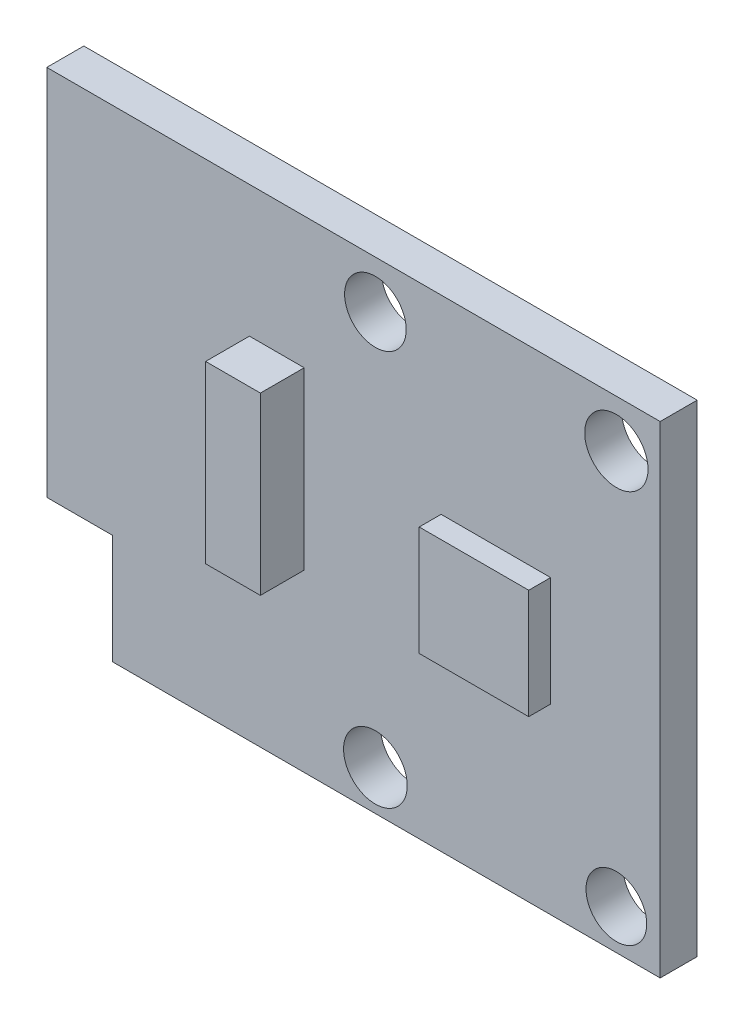
ISO-10303-21;
HEADER;
FILE_DESCRIPTION(('STEP AP214'),'2;1');
FILE_NAME('part.step','',(''),(''),'','','');
FILE_SCHEMA(('AUTOMOTIVE_DESIGN { 1 0 10303 214 1 1 1 1 }'));
ENDSEC;
DATA;
#1=APPLICATION_CONTEXT('core data for automotive mechanical design processes');
#2=APPLICATION_PROTOCOL_DEFINITION('international standard','automotive_design',2000,#1);
#3=PRODUCT_CONTEXT('',#1,'mechanical');
#4=PRODUCT('Part','Part','',(#3));
#5=PRODUCT_RELATED_PRODUCT_CATEGORY('part','',(#4));
#6=PRODUCT_DEFINITION_FORMATION('','',#4);
#7=PRODUCT_DEFINITION_CONTEXT('part definition',#1,'design');
#8=PRODUCT_DEFINITION('design','',#6,#7);
#9=PRODUCT_DEFINITION_SHAPE('','',#8);
#10=(LENGTH_UNIT() NAMED_UNIT(*) SI_UNIT(.MILLI.,.METRE.));
#11=(NAMED_UNIT(*) PLANE_ANGLE_UNIT() SI_UNIT($,.RADIAN.));
#12=(NAMED_UNIT(*) SI_UNIT($,.STERADIAN.) SOLID_ANGLE_UNIT());
#13=UNCERTAINTY_MEASURE_WITH_UNIT(LENGTH_MEASURE(1.E-05),#10,'distance_accuracy_value','');
#14=(GEOMETRIC_REPRESENTATION_CONTEXT(3) GLOBAL_UNCERTAINTY_ASSIGNED_CONTEXT((#13)) GLOBAL_UNIT_ASSIGNED_CONTEXT((#10,
#11,#12)) REPRESENTATION_CONTEXT('',''));
#15=CARTESIAN_POINT('',(0.,0.,0.));
#16=DIRECTION('',(0.,0.,1.));
#17=DIRECTION('',(1.,0.,0.));
#18=AXIS2_PLACEMENT_3D('',#15,#16,#17);
#19=CARTESIAN_POINT('',(0.,0.,1.69));
#20=DIRECTION('',(0.,0.,-1.));
#21=DIRECTION('',(-1.,0.,0.));
#22=AXIS2_PLACEMENT_3D('',#19,#20,#21);
#23=PLANE('',#22);
#24=DIRECTION('',(0.,-1.,0.));
#25=VECTOR('',#24,1.);
#26=CARTESIAN_POINT('',(18.,13.3304019796908,1.69));
#27=LINE('',#26,#25);
#28=CARTESIAN_POINT('',(18.,13.3304019796908,1.69));
#29=VERTEX_POINT('',#28);
#30=CARTESIAN_POINT('',(18.,8.33040197969078,1.69));
#31=VERTEX_POINT('',#30);
#32=EDGE_CURVE('E229',#29,#31,#27,.T.);
#33=ORIENTED_EDGE('',*,*,#32,.F.);
#34=DIRECTION('',(-1.,0.,0.));
#35=VECTOR('',#34,1.);
#36=CARTESIAN_POINT('',(18.,13.3304019796908,1.69));
#37=LINE('',#36,#35);
#38=CARTESIAN_POINT('',(23.,13.3304019796908,1.69));
#39=VERTEX_POINT('',#38);
#40=EDGE_CURVE('E234',#39,#29,#37,.T.);
#41=ORIENTED_EDGE('',*,*,#40,.F.);
#42=DIRECTION('',(0.,1.,0.));
#43=VECTOR('',#42,1.);
#44=CARTESIAN_POINT('',(23.,13.3304019796908,1.69));
#45=LINE('',#44,#43);
#46=CARTESIAN_POINT('',(23.,8.33040197969078,1.69));
#47=VERTEX_POINT('',#46);
#48=EDGE_CURVE('E246',#47,#39,#45,.T.);
#49=ORIENTED_EDGE('',*,*,#48,.F.);
#50=DIRECTION('',(1.,0.,0.));
#51=VECTOR('',#50,1.);
#52=CARTESIAN_POINT('',(18.,8.33040197969078,1.69));
#53=LINE('',#52,#51);
#54=EDGE_CURVE('E243',#31,#47,#53,.T.);
#55=ORIENTED_EDGE('',*,*,#54,.F.);
#56=EDGE_LOOP('',(#33,#41,#49,#55));
#57=FACE_BOUND('',#56,.T.);
#58=CARTESIAN_POINT('',(26.,1.8262889014553,1.69));
#59=DIRECTION('',(0.,0.,1.));
#60=DIRECTION('',(1.,0.,0.));
#61=AXIS2_PLACEMENT_3D('',#58,#59,#60);
#62=CIRCLE('',#61,1.38590599606651);
#63=CARTESIAN_POINT('',(27.3859059960665,1.8262889014553,1.69));
#64=VERTEX_POINT('',#63);
#65=EDGE_CURVE('E267',#64,#64,#62,.T.);
#66=ORIENTED_EDGE('',*,*,#65,.F.);
#67=EDGE_LOOP('',(#66));
#68=FACE_BOUND('',#67,.T.);
#69=CARTESIAN_POINT('',(15.,1.8262889014553,1.69));
#70=DIRECTION('',(0.,0.,1.));
#71=DIRECTION('',(1.,0.,0.));
#72=AXIS2_PLACEMENT_3D('',#69,#70,#71);
#73=CIRCLE('',#72,1.45322335303376);
#74=CARTESIAN_POINT('',(16.4532233530338,1.8262889014553,1.69));
#75=VERTEX_POINT('',#74);
#76=EDGE_CURVE('E273',#75,#75,#73,.T.);
#77=ORIENTED_EDGE('',*,*,#76,.F.);
#78=EDGE_LOOP('',(#77));
#79=FACE_BOUND('',#78,.T.);
#80=CARTESIAN_POINT('',(15.,19.8345150579263,1.69));
#81=DIRECTION('',(0.,0.,1.));
#82=DIRECTION('',(1.,0.,0.));
#83=AXIS2_PLACEMENT_3D('',#80,#81,#82);
#84=CIRCLE('',#83,1.40633814474217);
#85=CARTESIAN_POINT('',(16.4063381447422,19.8345150579263,1.69));
#86=VERTEX_POINT('',#85);
#87=EDGE_CURVE('E262',#86,#86,#84,.T.);
#88=ORIENTED_EDGE('',*,*,#87,.F.);
#89=EDGE_LOOP('',(#88));
#90=FACE_BOUND('',#89,.T.);
#91=CARTESIAN_POINT('',(26.,19.8345150579263,1.69));
#92=DIRECTION('',(0.,0.,1.));
#93=DIRECTION('',(1.,0.,0.));
#94=AXIS2_PLACEMENT_3D('',#91,#92,#93);
#95=CIRCLE('',#94,1.44535030177227);
#96=CARTESIAN_POINT('',(27.4453503017723,19.8345150579263,1.69));
#97=VERTEX_POINT('',#96);
#98=EDGE_CURVE('E266',#97,#97,#95,.T.);
#99=ORIENTED_EDGE('',*,*,#98,.F.);
#100=EDGE_LOOP('',(#99));
#101=FACE_BOUND('',#100,.T.);
#102=DIRECTION('',(0.,-1.,0.));
#103=VECTOR('',#102,1.);
#104=CARTESIAN_POINT('',(0.,0.,1.69));
#105=LINE('',#104,#103);
#106=CARTESIAN_POINT('',(0.,22.,1.69));
#107=VERTEX_POINT('',#106);
#108=CARTESIAN_POINT('',(0.,5.,1.69));
#109=VERTEX_POINT('',#108);
#110=EDGE_CURVE('E152',#107,#109,#105,.T.);
#111=ORIENTED_EDGE('',*,*,#110,.T.);
#112=DIRECTION('',(-1.,0.,0.));
#113=VECTOR('',#112,1.);
#114=CARTESIAN_POINT('',(0.,5.,1.69));
#115=LINE('',#114,#113);
#116=CARTESIAN_POINT('',(3.,5.,1.69));
#117=VERTEX_POINT('',#116);
#118=EDGE_CURVE('E140',#117,#109,#115,.T.);
#119=ORIENTED_EDGE('',*,*,#118,.F.);
#120=DIRECTION('',(0.,1.,0.));
#121=VECTOR('',#120,1.);
#122=CARTESIAN_POINT('',(3.,5.,1.69));
#123=LINE('',#122,#121);
#124=CARTESIAN_POINT('',(3.,0.,1.69));
#125=VERTEX_POINT('',#124);
#126=EDGE_CURVE('E134',#125,#117,#123,.T.);
#127=ORIENTED_EDGE('',*,*,#126,.F.);
#128=DIRECTION('',(1.,0.,0.));
#129=VECTOR('',#128,1.);
#130=CARTESIAN_POINT('',(0.,0.,1.69));
#131=LINE('',#130,#129);
#132=CARTESIAN_POINT('',(28.,0.,1.69));
#133=VERTEX_POINT('',#132);
#134=EDGE_CURVE('E144',#125,#133,#131,.T.);
#135=ORIENTED_EDGE('',*,*,#134,.T.);
#136=DIRECTION('',(0.,1.,0.));
#137=VECTOR('',#136,1.);
#138=CARTESIAN_POINT('',(28.,0.,1.69));
#139=LINE('',#138,#137);
#140=CARTESIAN_POINT('',(28.,22.,1.69));
#141=VERTEX_POINT('',#140);
#142=EDGE_CURVE('E151',#133,#141,#139,.T.);
#143=ORIENTED_EDGE('',*,*,#142,.T.);
#144=DIRECTION('',(-1.,0.,0.));
#145=VECTOR('',#144,1.);
#146=CARTESIAN_POINT('',(0.,22.,1.69));
#147=LINE('',#146,#145);
#148=EDGE_CURVE('E154',#141,#107,#147,.T.);
#149=ORIENTED_EDGE('',*,*,#148,.T.);
#150=EDGE_LOOP('',(#111,#119,#127,#135,#143,#149));
#151=FACE_BOUND('',#150,.T.);
#152=DIRECTION('',(0.,-1.,0.));
#153=VECTOR('',#152,1.);
#154=CARTESIAN_POINT('',(9.25000000000001,16.,1.69));
#155=LINE('',#154,#153);
#156=CARTESIAN_POINT('',(9.25000000000001,16.,1.69));
#157=VERTEX_POINT('',#156);
#158=CARTESIAN_POINT('',(9.25000000000001,8.,1.69));
#159=VERTEX_POINT('',#158);
#160=EDGE_CURVE('E195',#157,#159,#155,.T.);
#161=ORIENTED_EDGE('',*,*,#160,.F.);
#162=DIRECTION('',(-1.,0.,0.));
#163=VECTOR('',#162,1.);
#164=CARTESIAN_POINT('',(9.25000000000001,16.,1.69));
#165=LINE('',#164,#163);
#166=CARTESIAN_POINT('',(11.75,16.,1.69));
#167=VERTEX_POINT('',#166);
#168=EDGE_CURVE('E206',#167,#157,#165,.T.);
#169=ORIENTED_EDGE('',*,*,#168,.F.);
#170=DIRECTION('',(0.,1.,0.));
#171=VECTOR('',#170,1.);
#172=CARTESIAN_POINT('',(11.75,16.,1.69));
#173=LINE('',#172,#171);
#174=CARTESIAN_POINT('',(11.75,8.,1.69));
#175=VERTEX_POINT('',#174);
#176=EDGE_CURVE('E214',#175,#167,#173,.T.);
#177=ORIENTED_EDGE('',*,*,#176,.F.);
#178=DIRECTION('',(1.,0.,0.));
#179=VECTOR('',#178,1.);
#180=CARTESIAN_POINT('',(9.25000000000001,8.,1.69));
#181=LINE('',#180,#179);
#182=EDGE_CURVE('E55',#159,#175,#181,.T.);
#183=ORIENTED_EDGE('',*,*,#182,.F.);
#184=EDGE_LOOP('',(#161,#169,#177,#183));
#185=FACE_BOUND('',#184,.T.);
#186=ADVANCED_FACE('F33',(#57,#68,#79,#90,#101,#151,#185),#23,.F.);
#187=CARTESIAN_POINT('',(0.,0.,1.69));
#188=DIRECTION('',(1.,0.,0.));
#189=DIRECTION('',(0.,0.,-1.));
#190=AXIS2_PLACEMENT_3D('',#187,#188,#189);
#191=PLANE('',#190);
#192=DIRECTION('',(0.,-1.,0.));
#193=VECTOR('',#192,1.);
#194=CARTESIAN_POINT('',(0.,0.,0.));
#195=LINE('',#194,#193);
#196=CARTESIAN_POINT('',(0.,22.,0.));
#197=VERTEX_POINT('',#196);
#198=CARTESIAN_POINT('',(0.,5.,0.));
#199=VERTEX_POINT('',#198);
#200=EDGE_CURVE('E162',#197,#199,#195,.T.);
#201=ORIENTED_EDGE('',*,*,#200,.T.);
#202=DIRECTION('',(0.,0.,1.));
#203=VECTOR('',#202,1.);
#204=CARTESIAN_POINT('',(0.,5.,-8.31));
#205=LINE('',#204,#203);
#206=EDGE_CURVE('E193',#199,#109,#205,.T.);
#207=ORIENTED_EDGE('',*,*,#206,.T.);
#208=ORIENTED_EDGE('',*,*,#110,.F.);
#209=DIRECTION('',(0.,0.,-1.));
#210=VECTOR('',#209,1.);
#211=CARTESIAN_POINT('',(0.,22.,1.69));
#212=LINE('',#211,#210);
#213=EDGE_CURVE('E161',#107,#197,#212,.T.);
#214=ORIENTED_EDGE('',*,*,#213,.T.);
#215=EDGE_LOOP('',(#201,#207,#208,#214));
#216=FACE_BOUND('',#215,.T.);
#217=ADVANCED_FACE('F35',(#216),#191,.F.);
#218=CARTESIAN_POINT('',(0.,0.,1.69));
#219=DIRECTION('',(0.,1.,0.));
#220=DIRECTION('',(0.,0.,1.));
#221=AXIS2_PLACEMENT_3D('',#218,#219,#220);
#222=PLANE('',#221);
#223=ORIENTED_EDGE('',*,*,#134,.F.);
#224=DIRECTION('',(0.,0.,1.));
#225=VECTOR('',#224,1.);
#226=CARTESIAN_POINT('',(3.,0.,-8.31));
#227=LINE('',#226,#225);
#228=CARTESIAN_POINT('',(3.,0.,0.));
#229=VERTEX_POINT('',#228);
#230=EDGE_CURVE('E131',#229,#125,#227,.T.);
#231=ORIENTED_EDGE('',*,*,#230,.F.);
#232=DIRECTION('',(1.,0.,0.));
#233=VECTOR('',#232,1.);
#234=CARTESIAN_POINT('',(0.,0.,0.));
#235=LINE('',#234,#233);
#236=CARTESIAN_POINT('',(28.,0.,0.));
#237=VERTEX_POINT('',#236);
#238=EDGE_CURVE('E165',#229,#237,#235,.T.);
#239=ORIENTED_EDGE('',*,*,#238,.T.);
#240=DIRECTION('',(0.,0.,-1.));
#241=VECTOR('',#240,1.);
#242=CARTESIAN_POINT('',(28.,0.,1.69));
#243=LINE('',#242,#241);
#244=EDGE_CURVE('E149',#133,#237,#243,.T.);
#245=ORIENTED_EDGE('',*,*,#244,.F.);
#246=EDGE_LOOP('',(#223,#231,#239,#245));
#247=FACE_BOUND('',#246,.T.);
#248=ADVANCED_FACE('F147',(#247),#222,.F.);
#249=CARTESIAN_POINT('',(28.,0.,1.69));
#250=DIRECTION('',(-1.,0.,0.));
#251=DIRECTION('',(0.,-1.,0.));
#252=AXIS2_PLACEMENT_3D('',#249,#250,#251);
#253=PLANE('',#252);
#254=DIRECTION('',(0.,1.,0.));
#255=VECTOR('',#254,1.);
#256=CARTESIAN_POINT('',(28.,0.,0.));
#257=LINE('',#256,#255);
#258=CARTESIAN_POINT('',(28.,22.,0.));
#259=VERTEX_POINT('',#258);
#260=EDGE_CURVE('E168',#237,#259,#257,.T.);
#261=ORIENTED_EDGE('',*,*,#260,.T.);
#262=DIRECTION('',(0.,0.,-1.));
#263=VECTOR('',#262,1.);
#264=CARTESIAN_POINT('',(28.,22.,1.69));
#265=LINE('',#264,#263);
#266=EDGE_CURVE('E173',#141,#259,#265,.T.);
#267=ORIENTED_EDGE('',*,*,#266,.F.);
#268=ORIENTED_EDGE('',*,*,#142,.F.);
#269=ORIENTED_EDGE('',*,*,#244,.T.);
#270=EDGE_LOOP('',(#261,#267,#268,#269));
#271=FACE_BOUND('',#270,.T.);
#272=ADVANCED_FACE('F178',(#271),#253,.F.);
#273=CARTESIAN_POINT('',(0.,22.,1.69));
#274=DIRECTION('',(0.,-1.,0.));
#275=DIRECTION('',(0.,0.,-1.));
#276=AXIS2_PLACEMENT_3D('',#273,#274,#275);
#277=PLANE('',#276);
#278=DIRECTION('',(-1.,0.,0.));
#279=VECTOR('',#278,1.);
#280=CARTESIAN_POINT('',(0.,22.,0.));
#281=LINE('',#280,#279);
#282=EDGE_CURVE('E156',#259,#197,#281,.T.);
#283=ORIENTED_EDGE('',*,*,#282,.T.);
#284=ORIENTED_EDGE('',*,*,#213,.F.);
#285=ORIENTED_EDGE('',*,*,#148,.F.);
#286=ORIENTED_EDGE('',*,*,#266,.T.);
#287=EDGE_LOOP('',(#283,#284,#285,#286));
#288=FACE_BOUND('',#287,.T.);
#289=ADVANCED_FACE('F188',(#288),#277,.F.);
#290=CARTESIAN_POINT('',(0.,0.,0.));
#291=DIRECTION('',(0.,0.,-1.));
#292=DIRECTION('',(-1.,0.,0.));
#293=AXIS2_PLACEMENT_3D('',#290,#291,#292);
#294=PLANE('',#293);
#295=DIRECTION('',(1.,0.,0.));
#296=VECTOR('',#295,1.);
#297=CARTESIAN_POINT('',(0.,5.,0.));
#298=LINE('',#297,#296);
#299=CARTESIAN_POINT('',(3.,5.,0.));
#300=VERTEX_POINT('',#299);
#301=EDGE_CURVE('E11',#199,#300,#298,.T.);
#302=ORIENTED_EDGE('',*,*,#301,.F.);
#303=ORIENTED_EDGE('',*,*,#200,.F.);
#304=ORIENTED_EDGE('',*,*,#282,.F.);
#305=ORIENTED_EDGE('',*,*,#260,.F.);
#306=ORIENTED_EDGE('',*,*,#238,.F.);
#307=DIRECTION('',(0.,-1.,0.));
#308=VECTOR('',#307,1.);
#309=CARTESIAN_POINT('',(3.,0.,0.));
#310=LINE('',#309,#308);
#311=EDGE_CURVE('E41',#300,#229,#310,.T.);
#312=ORIENTED_EDGE('',*,*,#311,.F.);
#313=EDGE_LOOP('',(#302,#303,#304,#305,#306,#312));
#314=FACE_BOUND('',#313,.T.);
#315=CARTESIAN_POINT('',(26.,1.8262889014553,0.));
#316=DIRECTION('',(0.,0.,1.));
#317=DIRECTION('',(1.,0.,0.));
#318=AXIS2_PLACEMENT_3D('',#315,#316,#317);
#319=CIRCLE('',#318,1.38590599606651);
#320=CARTESIAN_POINT('',(27.3859059960665,1.8262889014553,0.));
#321=VERTEX_POINT('',#320);
#322=EDGE_CURVE('E263',#321,#321,#319,.T.);
#323=ORIENTED_EDGE('',*,*,#322,.T.);
#324=EDGE_LOOP('',(#323));
#325=FACE_BOUND('',#324,.T.);
#326=CARTESIAN_POINT('',(15.,1.8262889014553,0.));
#327=DIRECTION('',(0.,0.,1.));
#328=DIRECTION('',(1.,0.,0.));
#329=AXIS2_PLACEMENT_3D('',#326,#327,#328);
#330=CIRCLE('',#329,1.45322335303376);
#331=CARTESIAN_POINT('',(16.4532233530338,1.8262889014553,0.));
#332=VERTEX_POINT('',#331);
#333=EDGE_CURVE('E270',#332,#332,#330,.T.);
#334=ORIENTED_EDGE('',*,*,#333,.T.);
#335=EDGE_LOOP('',(#334));
#336=FACE_BOUND('',#335,.T.);
#337=CARTESIAN_POINT('',(15.,19.8345150579263,0.));
#338=DIRECTION('',(0.,0.,1.));
#339=DIRECTION('',(1.,0.,0.));
#340=AXIS2_PLACEMENT_3D('',#337,#338,#339);
#341=CIRCLE('',#340,1.40633814474217);
#342=CARTESIAN_POINT('',(16.4063381447422,19.8345150579263,0.));
#343=VERTEX_POINT('',#342);
#344=EDGE_CURVE('E276',#343,#343,#341,.T.);
#345=ORIENTED_EDGE('',*,*,#344,.T.);
#346=EDGE_LOOP('',(#345));
#347=FACE_BOUND('',#346,.T.);
#348=CARTESIAN_POINT('',(26.,19.8345150579263,0.));
#349=DIRECTION('',(0.,0.,1.));
#350=DIRECTION('',(1.,0.,0.));
#351=AXIS2_PLACEMENT_3D('',#348,#349,#350);
#352=CIRCLE('',#351,1.44535030177227);
#353=CARTESIAN_POINT('',(27.4453503017723,19.8345150579263,0.));
#354=VERTEX_POINT('',#353);
#355=EDGE_CURVE('E166',#354,#354,#352,.T.);
#356=ORIENTED_EDGE('',*,*,#355,.T.);
#357=EDGE_LOOP('',(#356));
#358=FACE_BOUND('',#357,.T.);
#359=ADVANCED_FACE('F183',(#314,#325,#336,#347,#358),#294,.T.);
#360=CARTESIAN_POINT('',(26.,19.8345150579263,0.));
#361=DIRECTION('',(0.,0.,1.));
#362=DIRECTION('',(1.,0.,0.));
#363=AXIS2_PLACEMENT_3D('',#360,#361,#362);
#364=CYLINDRICAL_SURFACE('',#363,1.44535030177227);
#365=ORIENTED_EDGE('',*,*,#355,.F.);
#366=EDGE_LOOP('',(#365));
#367=FACE_BOUND('',#366,.T.);
#368=ORIENTED_EDGE('',*,*,#98,.T.);
#369=EDGE_LOOP('',(#368));
#370=FACE_BOUND('',#369,.T.);
#371=ADVANCED_FACE('F285',(#367,#370),#364,.F.);
#372=CARTESIAN_POINT('',(15.,19.8345150579263,0.));
#373=DIRECTION('',(0.,0.,1.));
#374=DIRECTION('',(1.,0.,0.));
#375=AXIS2_PLACEMENT_3D('',#372,#373,#374);
#376=CYLINDRICAL_SURFACE('',#375,1.40633814474217);
#377=ORIENTED_EDGE('',*,*,#344,.F.);
#378=EDGE_LOOP('',(#377));
#379=FACE_BOUND('',#378,.T.);
#380=ORIENTED_EDGE('',*,*,#87,.T.);
#381=EDGE_LOOP('',(#380));
#382=FACE_BOUND('',#381,.T.);
#383=ADVANCED_FACE('F380',(#379,#382),#376,.F.);
#384=CARTESIAN_POINT('',(15.,1.8262889014553,0.));
#385=DIRECTION('',(0.,0.,1.));
#386=DIRECTION('',(1.,0.,0.));
#387=AXIS2_PLACEMENT_3D('',#384,#385,#386);
#388=CYLINDRICAL_SURFACE('',#387,1.45322335303376);
#389=ORIENTED_EDGE('',*,*,#333,.F.);
#390=EDGE_LOOP('',(#389));
#391=FACE_BOUND('',#390,.T.);
#392=ORIENTED_EDGE('',*,*,#76,.T.);
#393=EDGE_LOOP('',(#392));
#394=FACE_BOUND('',#393,.T.);
#395=ADVANCED_FACE('F377',(#391,#394),#388,.F.);
#396=CARTESIAN_POINT('',(26.,1.8262889014553,0.));
#397=DIRECTION('',(0.,0.,1.));
#398=DIRECTION('',(1.,0.,0.));
#399=AXIS2_PLACEMENT_3D('',#396,#397,#398);
#400=CYLINDRICAL_SURFACE('',#399,1.38590599606651);
#401=ORIENTED_EDGE('',*,*,#322,.F.);
#402=EDGE_LOOP('',(#401));
#403=FACE_BOUND('',#402,.T.);
#404=ORIENTED_EDGE('',*,*,#65,.T.);
#405=EDGE_LOOP('',(#404));
#406=FACE_BOUND('',#405,.T.);
#407=ADVANCED_FACE('F373',(#403,#406),#400,.F.);
#408=CARTESIAN_POINT('',(18.,13.3304019796908,2.69));
#409=DIRECTION('',(1.,0.,0.));
#410=DIRECTION('',(0.,1.,0.));
#411=AXIS2_PLACEMENT_3D('',#408,#409,#410);
#412=PLANE('',#411);
#413=ORIENTED_EDGE('',*,*,#32,.T.);
#414=DIRECTION('',(0.,0.,-1.));
#415=VECTOR('',#414,1.);
#416=CARTESIAN_POINT('',(18.,8.33040197969078,2.69));
#417=LINE('',#416,#415);
#418=CARTESIAN_POINT('',(18.,8.33040197969078,2.69));
#419=VERTEX_POINT('',#418);
#420=EDGE_CURVE('E259',#419,#31,#417,.T.);
#421=ORIENTED_EDGE('',*,*,#420,.F.);
#422=DIRECTION('',(0.,-1.,0.));
#423=VECTOR('',#422,1.);
#424=CARTESIAN_POINT('',(18.,13.3304019796908,2.69));
#425=LINE('',#424,#423);
#426=CARTESIAN_POINT('',(18.,13.3304019796908,2.69));
#427=VERTEX_POINT('',#426);
#428=EDGE_CURVE('E230',#427,#419,#425,.T.);
#429=ORIENTED_EDGE('',*,*,#428,.F.);
#430=DIRECTION('',(0.,0.,-1.));
#431=VECTOR('',#430,1.);
#432=CARTESIAN_POINT('',(18.,13.3304019796908,2.69));
#433=LINE('',#432,#431);
#434=EDGE_CURVE('E240',#427,#29,#433,.T.);
#435=ORIENTED_EDGE('',*,*,#434,.T.);
#436=EDGE_LOOP('',(#413,#421,#429,#435));
#437=FACE_BOUND('',#436,.T.);
#438=ADVANCED_FACE('F369',(#437),#412,.F.);
#439=CARTESIAN_POINT('',(18.,8.33040197969078,2.69));
#440=DIRECTION('',(0.,1.,0.));
#441=DIRECTION('',(0.,0.,1.));
#442=AXIS2_PLACEMENT_3D('',#439,#440,#441);
#443=PLANE('',#442);
#444=ORIENTED_EDGE('',*,*,#54,.T.);
#445=DIRECTION('',(0.,0.,-1.));
#446=VECTOR('',#445,1.);
#447=CARTESIAN_POINT('',(23.,8.33040197969078,2.69));
#448=LINE('',#447,#446);
#449=CARTESIAN_POINT('',(23.,8.33040197969078,2.69));
#450=VERTEX_POINT('',#449);
#451=EDGE_CURVE('E256',#450,#47,#448,.T.);
#452=ORIENTED_EDGE('',*,*,#451,.F.);
#453=DIRECTION('',(1.,0.,0.));
#454=VECTOR('',#453,1.);
#455=CARTESIAN_POINT('',(18.,8.33040197969078,2.69));
#456=LINE('',#455,#454);
#457=EDGE_CURVE('E233',#419,#450,#456,.T.);
#458=ORIENTED_EDGE('',*,*,#457,.F.);
#459=ORIENTED_EDGE('',*,*,#420,.T.);
#460=EDGE_LOOP('',(#444,#452,#458,#459));
#461=FACE_BOUND('',#460,.T.);
#462=ADVANCED_FACE('F365',(#461),#443,.F.);
#463=CARTESIAN_POINT('',(23.,13.3304019796908,2.69));
#464=DIRECTION('',(-1.,0.,0.));
#465=DIRECTION('',(0.,-1.,0.));
#466=AXIS2_PLACEMENT_3D('',#463,#464,#465);
#467=PLANE('',#466);
#468=ORIENTED_EDGE('',*,*,#48,.T.);
#469=DIRECTION('',(0.,0.,-1.));
#470=VECTOR('',#469,1.);
#471=CARTESIAN_POINT('',(23.,13.3304019796908,2.69));
#472=LINE('',#471,#470);
#473=CARTESIAN_POINT('',(23.,13.3304019796908,2.69));
#474=VERTEX_POINT('',#473);
#475=EDGE_CURVE('E253',#474,#39,#472,.T.);
#476=ORIENTED_EDGE('',*,*,#475,.F.);
#477=DIRECTION('',(0.,1.,0.));
#478=VECTOR('',#477,1.);
#479=CARTESIAN_POINT('',(23.,13.3304019796908,2.69));
#480=LINE('',#479,#478);
#481=EDGE_CURVE('E236',#450,#474,#480,.T.);
#482=ORIENTED_EDGE('',*,*,#481,.F.);
#483=ORIENTED_EDGE('',*,*,#451,.T.);
#484=EDGE_LOOP('',(#468,#476,#482,#483));
#485=FACE_BOUND('',#484,.T.);
#486=ADVANCED_FACE('F361',(#485),#467,.F.);
#487=CARTESIAN_POINT('',(18.,13.3304019796908,2.69));
#488=DIRECTION('',(0.,-1.,0.));
#489=DIRECTION('',(0.,0.,-1.));
#490=AXIS2_PLACEMENT_3D('',#487,#488,#489);
#491=PLANE('',#490);
#492=ORIENTED_EDGE('',*,*,#40,.T.);
#493=ORIENTED_EDGE('',*,*,#434,.F.);
#494=DIRECTION('',(-1.,0.,0.));
#495=VECTOR('',#494,1.);
#496=CARTESIAN_POINT('',(18.,13.3304019796908,2.69));
#497=LINE('',#496,#495);
#498=EDGE_CURVE('E238',#474,#427,#497,.T.);
#499=ORIENTED_EDGE('',*,*,#498,.F.);
#500=ORIENTED_EDGE('',*,*,#475,.T.);
#501=EDGE_LOOP('',(#492,#493,#499,#500));
#502=FACE_BOUND('',#501,.T.);
#503=ADVANCED_FACE('F357',(#502),#491,.F.);
#504=CARTESIAN_POINT('',(0.,0.,2.69));
#505=DIRECTION('',(0.,0.,1.));
#506=DIRECTION('',(1.,0.,0.));
#507=AXIS2_PLACEMENT_3D('',#504,#505,#506);
#508=PLANE('',#507);
#509=ORIENTED_EDGE('',*,*,#428,.T.);
#510=ORIENTED_EDGE('',*,*,#457,.T.);
#511=ORIENTED_EDGE('',*,*,#481,.T.);
#512=ORIENTED_EDGE('',*,*,#498,.T.);
#513=EDGE_LOOP('',(#509,#510,#511,#512));
#514=FACE_BOUND('',#513,.T.);
#515=ADVANCED_FACE('F353',(#514),#508,.T.);
#516=CARTESIAN_POINT('',(9.25000000000001,16.,3.69));
#517=DIRECTION('',(1.,0.,0.));
#518=DIRECTION('',(0.,0.,-1.));
#519=AXIS2_PLACEMENT_3D('',#516,#517,#518);
#520=PLANE('',#519);
#521=ORIENTED_EDGE('',*,*,#160,.T.);
#522=DIRECTION('',(0.,0.,-1.));
#523=VECTOR('',#522,1.);
#524=CARTESIAN_POINT('',(9.25000000000001,8.,3.69));
#525=LINE('',#524,#523);
#526=CARTESIAN_POINT('',(9.25000000000001,8.,3.69));
#527=VERTEX_POINT('',#526);
#528=EDGE_CURVE('E227',#527,#159,#525,.T.);
#529=ORIENTED_EDGE('',*,*,#528,.F.);
#530=DIRECTION('',(0.,-1.,0.));
#531=VECTOR('',#530,1.);
#532=CARTESIAN_POINT('',(9.25000000000001,16.,3.69));
#533=LINE('',#532,#531);
#534=CARTESIAN_POINT('',(9.25000000000001,16.,3.69));
#535=VERTEX_POINT('',#534);
#536=EDGE_CURVE('E202',#535,#527,#533,.T.);
#537=ORIENTED_EDGE('',*,*,#536,.F.);
#538=DIRECTION('',(0.,0.,-1.));
#539=VECTOR('',#538,1.);
#540=CARTESIAN_POINT('',(9.25000000000001,16.,3.69));
#541=LINE('',#540,#539);
#542=EDGE_CURVE('E211',#535,#157,#541,.T.);
#543=ORIENTED_EDGE('',*,*,#542,.T.);
#544=EDGE_LOOP('',(#521,#529,#537,#543));
#545=FACE_BOUND('',#544,.T.);
#546=ADVANCED_FACE('F349',(#545),#520,.F.);
#547=CARTESIAN_POINT('',(9.25000000000001,8.,3.69));
#548=DIRECTION('',(0.,1.,0.));
#549=DIRECTION('',(0.,0.,1.));
#550=AXIS2_PLACEMENT_3D('',#547,#548,#549);
#551=PLANE('',#550);
#552=ORIENTED_EDGE('',*,*,#182,.T.);
#553=DIRECTION('',(0.,0.,-1.));
#554=VECTOR('',#553,1.);
#555=CARTESIAN_POINT('',(11.75,8.,3.69));
#556=LINE('',#555,#554);
#557=CARTESIAN_POINT('',(11.75,8.,3.69));
#558=VERTEX_POINT('',#557);
#559=EDGE_CURVE('E224',#558,#175,#556,.T.);
#560=ORIENTED_EDGE('',*,*,#559,.F.);
#561=DIRECTION('',(1.,0.,0.));
#562=VECTOR('',#561,1.);
#563=CARTESIAN_POINT('',(9.25000000000001,8.,3.69));
#564=LINE('',#563,#562);
#565=EDGE_CURVE('E205',#527,#558,#564,.T.);
#566=ORIENTED_EDGE('',*,*,#565,.F.);
#567=ORIENTED_EDGE('',*,*,#528,.T.);
#568=EDGE_LOOP('',(#552,#560,#566,#567));
#569=FACE_BOUND('',#568,.T.);
#570=ADVANCED_FACE('F345',(#569),#551,.F.);
#571=CARTESIAN_POINT('',(11.75,16.,3.69));
#572=DIRECTION('',(-1.,0.,0.));
#573=DIRECTION('',(0.,0.,1.));
#574=AXIS2_PLACEMENT_3D('',#571,#572,#573);
#575=PLANE('',#574);
#576=ORIENTED_EDGE('',*,*,#176,.T.);
#577=DIRECTION('',(0.,0.,-1.));
#578=VECTOR('',#577,1.);
#579=CARTESIAN_POINT('',(11.75,16.,3.69));
#580=LINE('',#579,#578);
#581=CARTESIAN_POINT('',(11.75,16.,3.69));
#582=VERTEX_POINT('',#581);
#583=EDGE_CURVE('E221',#582,#167,#580,.T.);
#584=ORIENTED_EDGE('',*,*,#583,.F.);
#585=DIRECTION('',(0.,1.,0.));
#586=VECTOR('',#585,1.);
#587=CARTESIAN_POINT('',(11.75,16.,3.69));
#588=LINE('',#587,#586);
#589=EDGE_CURVE('E208',#558,#582,#588,.T.);
#590=ORIENTED_EDGE('',*,*,#589,.F.);
#591=ORIENTED_EDGE('',*,*,#559,.T.);
#592=EDGE_LOOP('',(#576,#584,#590,#591));
#593=FACE_BOUND('',#592,.T.);
#594=ADVANCED_FACE('F341',(#593),#575,.F.);
#595=CARTESIAN_POINT('',(9.25000000000001,16.,3.69));
#596=DIRECTION('',(0.,-1.,0.));
#597=DIRECTION('',(0.,0.,-1.));
#598=AXIS2_PLACEMENT_3D('',#595,#596,#597);
#599=PLANE('',#598);
#600=ORIENTED_EDGE('',*,*,#168,.T.);
#601=ORIENTED_EDGE('',*,*,#542,.F.);
#602=DIRECTION('',(-1.,0.,0.));
#603=VECTOR('',#602,1.);
#604=CARTESIAN_POINT('',(9.25000000000001,16.,3.69));
#605=LINE('',#604,#603);
#606=EDGE_CURVE('E210',#582,#535,#605,.T.);
#607=ORIENTED_EDGE('',*,*,#606,.F.);
#608=ORIENTED_EDGE('',*,*,#583,.T.);
#609=EDGE_LOOP('',(#600,#601,#607,#608));
#610=FACE_BOUND('',#609,.T.);
#611=ADVANCED_FACE('F337',(#610),#599,.F.);
#612=CARTESIAN_POINT('',(0.,0.,3.69));
#613=DIRECTION('',(0.,0.,1.));
#614=DIRECTION('',(1.,0.,0.));
#615=AXIS2_PLACEMENT_3D('',#612,#613,#614);
#616=PLANE('',#615);
#617=ORIENTED_EDGE('',*,*,#536,.T.);
#618=ORIENTED_EDGE('',*,*,#565,.T.);
#619=ORIENTED_EDGE('',*,*,#589,.T.);
#620=ORIENTED_EDGE('',*,*,#606,.T.);
#621=EDGE_LOOP('',(#617,#618,#619,#620));
#622=FACE_BOUND('',#621,.T.);
#623=ADVANCED_FACE('F321',(#622),#616,.T.);
#624=CARTESIAN_POINT('',(0.,5.,-8.31));
#625=DIRECTION('',(0.,1.,0.));
#626=DIRECTION('',(0.,0.,1.));
#627=AXIS2_PLACEMENT_3D('',#624,#625,#626);
#628=PLANE('',#627);
#629=ORIENTED_EDGE('',*,*,#301,.T.);
#630=DIRECTION('',(0.,0.,1.));
#631=VECTOR('',#630,1.);
#632=CARTESIAN_POINT('',(3.,5.,-8.31));
#633=LINE('',#632,#631);
#634=EDGE_CURVE('E48',#300,#117,#633,.T.);
#635=ORIENTED_EDGE('',*,*,#634,.T.);
#636=ORIENTED_EDGE('',*,*,#118,.T.);
#637=ORIENTED_EDGE('',*,*,#206,.F.);
#638=EDGE_LOOP('',(#629,#635,#636,#637));
#639=FACE_BOUND('',#638,.T.);
#640=ADVANCED_FACE('F316',(#639),#628,.F.);
#641=CARTESIAN_POINT('',(3.,5.,-8.31));
#642=DIRECTION('',(1.,0.,0.));
#643=DIRECTION('',(0.,1.,0.));
#644=AXIS2_PLACEMENT_3D('',#641,#642,#643);
#645=PLANE('',#644);
#646=ORIENTED_EDGE('',*,*,#311,.T.);
#647=ORIENTED_EDGE('',*,*,#230,.T.);
#648=ORIENTED_EDGE('',*,*,#126,.T.);
#649=ORIENTED_EDGE('',*,*,#634,.F.);
#650=EDGE_LOOP('',(#646,#647,#648,#649));
#651=FACE_BOUND('',#650,.T.);
#652=ADVANCED_FACE('F133',(#651),#645,.F.);
#653=CLOSED_SHELL('',(#186,#217,#248,#272,#289,#359,#371,#383,#395,#407,#438,#462,#486,#503,
#515,#546,#570,#594,#611,#623,#640,#652));
#654=MANIFOLD_SOLID_BREP('B2',#653);
#655=ADVANCED_BREP_SHAPE_REPRESENTATION('',(#18,#654),#14);
#656=SHAPE_DEFINITION_REPRESENTATION(#9,#655);
ENDSEC;
END-ISO-10303-21;
